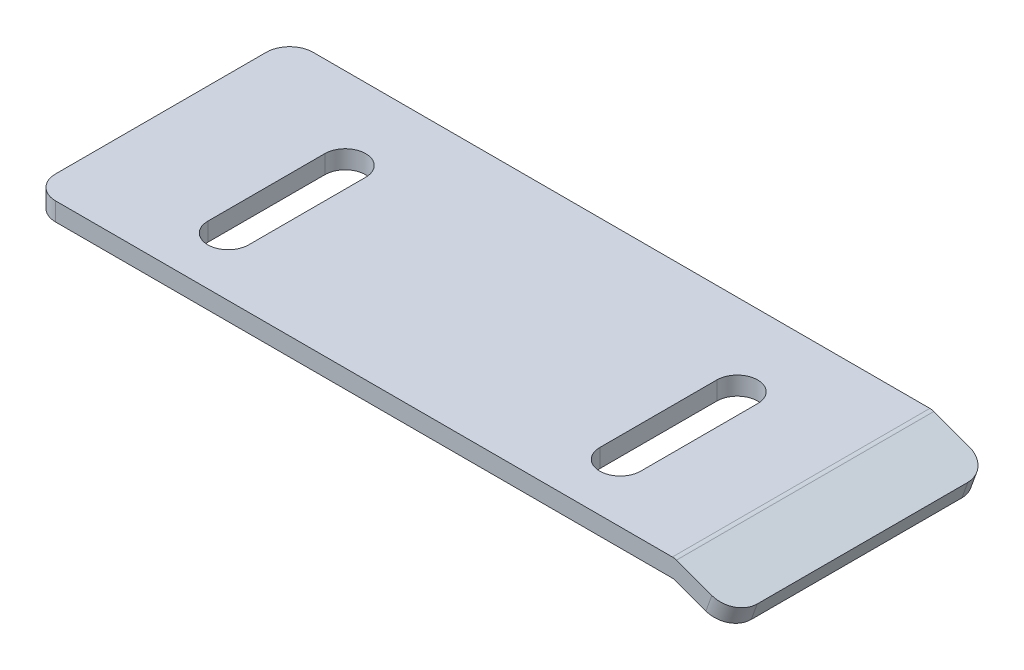
ISO-10303-21;
HEADER;
FILE_DESCRIPTION(('STEP AP214'),'2;1');
FILE_NAME('part.step','',(''),(''),'','','');
FILE_SCHEMA(('AUTOMOTIVE_DESIGN { 1 0 10303 214 1 1 1 1 }'));
ENDSEC;
DATA;
#1=APPLICATION_CONTEXT('core data for automotive mechanical design processes');
#2=APPLICATION_PROTOCOL_DEFINITION('international standard','automotive_design',2000,#1);
#3=PRODUCT_CONTEXT('',#1,'mechanical');
#4=PRODUCT('Part','Part','',(#3));
#5=PRODUCT_RELATED_PRODUCT_CATEGORY('part','',(#4));
#6=PRODUCT_DEFINITION_FORMATION('','',#4);
#7=PRODUCT_DEFINITION_CONTEXT('part definition',#1,'design');
#8=PRODUCT_DEFINITION('design','',#6,#7);
#9=PRODUCT_DEFINITION_SHAPE('','',#8);
#10=(LENGTH_UNIT() NAMED_UNIT(*) SI_UNIT(.MILLI.,.METRE.));
#11=(NAMED_UNIT(*) PLANE_ANGLE_UNIT() SI_UNIT($,.RADIAN.));
#12=(NAMED_UNIT(*) SI_UNIT($,.STERADIAN.) SOLID_ANGLE_UNIT());
#13=UNCERTAINTY_MEASURE_WITH_UNIT(LENGTH_MEASURE(1.E-05),#10,'distance_accuracy_value','');
#14=(GEOMETRIC_REPRESENTATION_CONTEXT(3) GLOBAL_UNCERTAINTY_ASSIGNED_CONTEXT((#13)) GLOBAL_UNIT_ASSIGNED_CONTEXT((#10,
#11,#12)) REPRESENTATION_CONTEXT('',''));
#15=CARTESIAN_POINT('',(0.,0.,0.));
#16=DIRECTION('',(0.,0.,1.));
#17=DIRECTION('',(1.,0.,0.));
#18=AXIS2_PLACEMENT_3D('',#15,#16,#17);
#19=CARTESIAN_POINT('',(-37.5773457805497,7.01414024321962,22.));
#20=DIRECTION('',(1.,0.,0.));
#21=DIRECTION('',(0.,1.,0.));
#22=AXIS2_PLACEMENT_3D('',#19,#20,#21);
#23=PLANE('',#22);
#24=DIRECTION('',(0.,0.,-1.));
#25=VECTOR('',#24,1.);
#26=CARTESIAN_POINT('',(-37.5773457805497,7.01414024321962,22.));
#27=LINE('',#26,#25);
#28=CARTESIAN_POINT('',(-37.5773457805497,7.01414024321962,20.));
#29=VERTEX_POINT('',#28);
#30=CARTESIAN_POINT('',(-37.5773457805497,7.01414024321962,2.));
#31=VERTEX_POINT('',#30);
#32=EDGE_CURVE('E264',#29,#31,#27,.T.);
#33=ORIENTED_EDGE('',*,*,#32,.F.);
#34=DIRECTION('',(0.,-1.,0.));
#35=VECTOR('',#34,1.);
#36=CARTESIAN_POINT('',(-37.5773457805497,7.01414024321962,20.));
#37=LINE('',#36,#35);
#38=CARTESIAN_POINT('',(-37.5773457805497,8.5792292670785,20.));
#39=VERTEX_POINT('',#38);
#40=EDGE_CURVE('E291',#29,#39,#37,.F.);
#41=ORIENTED_EDGE('',*,*,#40,.T.);
#42=DIRECTION('',(0.,0.,-1.));
#43=VECTOR('',#42,1.);
#44=CARTESIAN_POINT('',(-37.5773457805497,8.5792292670785,22.));
#45=LINE('',#44,#43);
#46=CARTESIAN_POINT('',(-37.5773457805497,8.5792292670785,2.));
#47=VERTEX_POINT('',#46);
#48=EDGE_CURVE('E244',#39,#47,#45,.T.);
#49=ORIENTED_EDGE('',*,*,#48,.T.);
#50=DIRECTION('',(0.,-1.,0.));
#51=VECTOR('',#50,1.);
#52=CARTESIAN_POINT('',(-37.5773457805497,7.01414024321962,2.));
#53=LINE('',#52,#51);
#54=EDGE_CURVE('E288',#47,#31,#53,.T.);
#55=ORIENTED_EDGE('',*,*,#54,.T.);
#56=EDGE_LOOP('',(#33,#41,#49,#55));
#57=FACE_BOUND('',#56,.T.);
#58=ADVANCED_FACE('F33',(#57),#23,.F.);
#59=CARTESIAN_POINT('',(17.2226542194503,7.01414024321963,22.));
#60=DIRECTION('',(0.,1.,0.));
#61=DIRECTION('',(-1.,0.,0.));
#62=AXIS2_PLACEMENT_3D('',#59,#60,#61);
#63=PLANE('',#62);
#64=DIRECTION('',(0.,0.,1.));
#65=VECTOR('',#64,1.);
#66=CARTESIAN_POINT('',(5.92265421945034,7.01414024321963,22.));
#67=LINE('',#66,#65);
#68=CARTESIAN_POINT('',(5.92265421945034,7.01414024321963,7.));
#69=VERTEX_POINT('',#68);
#70=CARTESIAN_POINT('',(5.92265421945034,7.01414024321963,17.));
#71=VERTEX_POINT('',#70);
#72=EDGE_CURVE('E194',#69,#71,#67,.T.);
#73=ORIENTED_EDGE('',*,*,#72,.T.);
#74=CARTESIAN_POINT('',(7.67265421945034,7.01414024321963,17.));
#75=DIRECTION('',(0.,1.,0.));
#76=DIRECTION('',(-1.,0.,0.));
#77=AXIS2_PLACEMENT_3D('',#74,#75,#76);
#78=CIRCLE('',#77,1.75);
#79=CARTESIAN_POINT('',(9.42265421945033,7.01414024321963,17.));
#80=VERTEX_POINT('',#79);
#81=EDGE_CURVE('E197',#71,#80,#78,.T.);
#82=ORIENTED_EDGE('',*,*,#81,.T.);
#83=DIRECTION('',(0.,0.,-1.));
#84=VECTOR('',#83,1.);
#85=CARTESIAN_POINT('',(9.42265421945033,7.01414024321963,22.));
#86=LINE('',#85,#84);
#87=CARTESIAN_POINT('',(9.42265421945033,7.01414024321963,7.));
#88=VERTEX_POINT('',#87);
#89=EDGE_CURVE('E189',#80,#88,#86,.T.);
#90=ORIENTED_EDGE('',*,*,#89,.T.);
#91=CARTESIAN_POINT('',(7.67265421945034,7.01414024321963,7.));
#92=DIRECTION('',(0.,1.,0.));
#93=DIRECTION('',(-1.,0.,0.));
#94=AXIS2_PLACEMENT_3D('',#91,#92,#93);
#95=CIRCLE('',#94,1.75);
#96=EDGE_CURVE('E169',#88,#69,#95,.T.);
#97=ORIENTED_EDGE('',*,*,#96,.T.);
#98=EDGE_LOOP('',(#73,#82,#90,#97));
#99=FACE_BOUND('',#98,.T.);
#100=DIRECTION('',(0.,0.,1.));
#101=VECTOR('',#100,1.);
#102=CARTESIAN_POINT('',(-27.5773457805497,7.01414024321962,22.));
#103=LINE('',#102,#101);
#104=CARTESIAN_POINT('',(-27.5773457805497,7.01414024321962,7.));
#105=VERTEX_POINT('',#104);
#106=CARTESIAN_POINT('',(-27.5773457805497,7.01414024321962,17.));
#107=VERTEX_POINT('',#106);
#108=EDGE_CURVE('E226',#105,#107,#103,.T.);
#109=ORIENTED_EDGE('',*,*,#108,.T.);
#110=CARTESIAN_POINT('',(-25.8273457805497,7.01414024321962,17.));
#111=DIRECTION('',(0.,1.,0.));
#112=DIRECTION('',(-1.,0.,0.));
#113=AXIS2_PLACEMENT_3D('',#110,#111,#112);
#114=CIRCLE('',#113,1.75);
#115=CARTESIAN_POINT('',(-24.0773457805497,7.01414024321962,17.));
#116=VERTEX_POINT('',#115);
#117=EDGE_CURVE('E229',#107,#116,#114,.T.);
#118=ORIENTED_EDGE('',*,*,#117,.T.);
#119=DIRECTION('',(0.,0.,-1.));
#120=VECTOR('',#119,1.);
#121=CARTESIAN_POINT('',(-24.0773457805497,7.01414024321962,22.));
#122=LINE('',#121,#120);
#123=CARTESIAN_POINT('',(-24.0773457805497,7.01414024321962,7.));
#124=VERTEX_POINT('',#123);
#125=EDGE_CURVE('E214',#116,#124,#122,.T.);
#126=ORIENTED_EDGE('',*,*,#125,.T.);
#127=CARTESIAN_POINT('',(-25.8273457805497,7.01414024321962,7.));
#128=DIRECTION('',(0.,1.,0.));
#129=DIRECTION('',(-1.,0.,0.));
#130=AXIS2_PLACEMENT_3D('',#127,#128,#129);
#131=CIRCLE('',#130,1.75);
#132=EDGE_CURVE('E223',#124,#105,#131,.T.);
#133=ORIENTED_EDGE('',*,*,#132,.T.);
#134=EDGE_LOOP('',(#109,#118,#126,#133));
#135=FACE_BOUND('',#134,.T.);
#136=DIRECTION('',(1.,0.,0.));
#137=VECTOR('',#136,1.);
#138=CARTESIAN_POINT('',(17.2226542194503,7.01414024321963,22.));
#139=LINE('',#138,#137);
#140=CARTESIAN_POINT('',(-35.5773457805496,7.01414024321962,22.));
#141=VERTEX_POINT('',#140);
#142=CARTESIAN_POINT('',(17.2226542194503,7.01414024321963,22.));
#143=VERTEX_POINT('',#142);
#144=EDGE_CURVE('E233',#141,#143,#139,.T.);
#145=ORIENTED_EDGE('',*,*,#144,.F.);
#146=CARTESIAN_POINT('',(-35.5773457805497,7.01414024321962,20.));
#147=DIRECTION('',(0.,1.,0.));
#148=DIRECTION('',(-1.,0.,0.));
#149=AXIS2_PLACEMENT_3D('',#146,#147,#148);
#150=CIRCLE('',#149,2.);
#151=EDGE_CURVE('E286',#141,#29,#150,.F.);
#152=ORIENTED_EDGE('',*,*,#151,.T.);
#153=ORIENTED_EDGE('',*,*,#32,.T.);
#154=CARTESIAN_POINT('',(-35.5773457805497,7.01414024321962,2.));
#155=DIRECTION('',(0.,1.,0.));
#156=DIRECTION('',(-1.,0.,0.));
#157=AXIS2_PLACEMENT_3D('',#154,#155,#156);
#158=CIRCLE('',#157,2.);
#159=CARTESIAN_POINT('',(-35.5773457805496,7.01414024321962,0.));
#160=VERTEX_POINT('',#159);
#161=EDGE_CURVE('E284',#31,#160,#158,.F.);
#162=ORIENTED_EDGE('',*,*,#161,.T.);
#163=DIRECTION('',(1.,0.,0.));
#164=VECTOR('',#163,1.);
#165=CARTESIAN_POINT('',(17.2226542194503,7.01414024321963,0.));
#166=LINE('',#165,#164);
#167=CARTESIAN_POINT('',(17.2226542194503,7.01414024321963,0.));
#168=VERTEX_POINT('',#167);
#169=EDGE_CURVE('E232',#160,#168,#166,.T.);
#170=ORIENTED_EDGE('',*,*,#169,.T.);
#171=DIRECTION('',(0.,0.,-1.));
#172=VECTOR('',#171,1.);
#173=CARTESIAN_POINT('',(17.2226542194503,7.01414024321963,22.));
#174=LINE('',#173,#172);
#175=EDGE_CURVE('E261',#143,#168,#174,.T.);
#176=ORIENTED_EDGE('',*,*,#175,.F.);
#177=EDGE_LOOP('',(#145,#152,#153,#162,#170,#176));
#178=FACE_BOUND('',#177,.T.);
#179=ADVANCED_FACE('F359',(#99,#135,#178),#63,.F.);
#180=CARTESIAN_POINT('',(21.8696240044618,5.32278156194103,22.));
#181=DIRECTION('',(0.342020143325669,0.939692620785908,0.));
#182=DIRECTION('',(-0.939692620785908,0.342020143325669,0.));
#183=AXIS2_PLACEMENT_3D('',#180,#181,#182);
#184=PLANE('',#183);
#185=DIRECTION('',(0.,0.,-1.));
#186=VECTOR('',#185,1.);
#187=CARTESIAN_POINT('',(21.8696240044618,5.32278156194103,22.));
#188=LINE('',#187,#186);
#189=CARTESIAN_POINT('',(21.8696240044618,5.32278156194103,20.));
#190=VERTEX_POINT('',#189);
#191=CARTESIAN_POINT('',(21.8696240044618,5.32278156194103,2.));
#192=VERTEX_POINT('',#191);
#193=EDGE_CURVE('E258',#190,#192,#188,.T.);
#194=ORIENTED_EDGE('',*,*,#193,.F.);
#195=CARTESIAN_POINT('',(19.99023876289,6.00682184859236,20.));
#196=DIRECTION('',(0.342020143325669,0.939692620785908,0.));
#197=DIRECTION('',(-0.939692620785908,0.342020143325669,0.));
#198=AXIS2_PLACEMENT_3D('',#195,#196,#197);
#199=CIRCLE('',#198,2.);
#200=CARTESIAN_POINT('',(19.99023876289,6.00682184859236,22.));
#201=VERTEX_POINT('',#200);
#202=EDGE_CURVE('E11',#190,#201,#199,.F.);
#203=ORIENTED_EDGE('',*,*,#202,.T.);
#204=DIRECTION('',(0.939692620785908,-0.342020143325669,0.));
#205=VECTOR('',#204,1.);
#206=CARTESIAN_POINT('',(21.8696240044618,5.32278156194103,22.));
#207=LINE('',#206,#205);
#208=EDGE_CURVE('E235',#143,#201,#207,.T.);
#209=ORIENTED_EDGE('',*,*,#208,.F.);
#210=ORIENTED_EDGE('',*,*,#175,.T.);
#211=DIRECTION('',(0.939692620785908,-0.342020143325669,0.));
#212=VECTOR('',#211,1.);
#213=CARTESIAN_POINT('',(21.8696240044618,5.32278156194103,0.));
#214=LINE('',#213,#212);
#215=CARTESIAN_POINT('',(19.99023876289,6.00682184859236,0.));
#216=VERTEX_POINT('',#215);
#217=EDGE_CURVE('E246',#168,#216,#214,.T.);
#218=ORIENTED_EDGE('',*,*,#217,.T.);
#219=CARTESIAN_POINT('',(19.99023876289,6.00682184859237,2.));
#220=DIRECTION('',(0.342020143325669,0.939692620785908,0.));
#221=DIRECTION('',(-0.939692620785908,0.342020143325669,0.));
#222=AXIS2_PLACEMENT_3D('',#219,#220,#221);
#223=CIRCLE('',#222,2.);
#224=EDGE_CURVE('E41',#216,#192,#223,.F.);
#225=ORIENTED_EDGE('',*,*,#224,.T.);
#226=EDGE_LOOP('',(#194,#203,#209,#210,#218,#225));
#227=FACE_BOUND('',#226,.T.);
#228=ADVANCED_FACE('F312',(#227),#184,.F.);
#229=CARTESIAN_POINT('',(22.3826542194503,6.73232049311989,22.));
#230=DIRECTION('',(-0.939692620785908,0.342020143325669,0.));
#231=DIRECTION('',(-0.342020143325669,-0.939692620785908,0.));
#232=AXIS2_PLACEMENT_3D('',#229,#230,#231);
#233=PLANE('',#232);
#234=DIRECTION('',(0.,0.,-1.));
#235=VECTOR('',#234,1.);
#236=CARTESIAN_POINT('',(22.3826542194503,6.73232049311989,22.));
#237=LINE('',#236,#235);
#238=CARTESIAN_POINT('',(22.3826542194503,6.73232049311989,20.));
#239=VERTEX_POINT('',#238);
#240=CARTESIAN_POINT('',(22.3826542194503,6.73232049311989,2.));
#241=VERTEX_POINT('',#240);
#242=EDGE_CURVE('E255',#239,#241,#237,.T.);
#243=ORIENTED_EDGE('',*,*,#242,.F.);
#244=DIRECTION('',(0.342020143325669,0.939692620785908,0.));
#245=VECTOR('',#244,1.);
#246=CARTESIAN_POINT('',(22.3826542194503,6.73232049311989,20.));
#247=LINE('',#246,#245);
#248=EDGE_CURVE('E308',#239,#190,#247,.F.);
#249=ORIENTED_EDGE('',*,*,#248,.T.);
#250=ORIENTED_EDGE('',*,*,#193,.T.);
#251=DIRECTION('',(0.342020143325669,0.939692620785908,0.));
#252=VECTOR('',#251,1.);
#253=CARTESIAN_POINT('',(22.3826542194503,6.73232049311989,2.));
#254=LINE('',#253,#252);
#255=EDGE_CURVE('E305',#192,#241,#254,.T.);
#256=ORIENTED_EDGE('',*,*,#255,.T.);
#257=EDGE_LOOP('',(#243,#249,#250,#256));
#258=FACE_BOUND('',#257,.T.);
#259=ADVANCED_FACE('F320',(#258),#233,.F.);
#260=CARTESIAN_POINT('',(17.3083140672064,8.5792292670785,22.));
#261=DIRECTION('',(-0.342020143325669,-0.939692620785908,0.));
#262=DIRECTION('',(0.939692620785908,-0.342020143325669,0.));
#263=AXIS2_PLACEMENT_3D('',#260,#261,#262);
#264=PLANE('',#263);
#265=DIRECTION('',(-0.939692620785908,0.342020143325669,0.));
#266=VECTOR('',#265,1.);
#267=CARTESIAN_POINT('',(17.3083140672064,8.5792292670785,22.));
#268=LINE('',#267,#266);
#269=CARTESIAN_POINT('',(20.5032689778785,7.41636077977123,22.));
#270=VERTEX_POINT('',#269);
#271=CARTESIAN_POINT('',(17.4740072298236,8.51892188786441,22.));
#272=VERTEX_POINT('',#271);
#273=EDGE_CURVE('E239',#270,#272,#268,.T.);
#274=ORIENTED_EDGE('',*,*,#273,.F.);
#275=CARTESIAN_POINT('',(20.5032689778785,7.41636077977123,20.));
#276=DIRECTION('',(-0.342020143325669,-0.939692620785908,0.));
#277=DIRECTION('',(0.939692620785908,-0.342020143325669,0.));
#278=AXIS2_PLACEMENT_3D('',#275,#276,#277);
#279=CIRCLE('',#278,2.);
#280=EDGE_CURVE('E303',#270,#239,#279,.F.);
#281=ORIENTED_EDGE('',*,*,#280,.T.);
#282=ORIENTED_EDGE('',*,*,#242,.T.);
#283=CARTESIAN_POINT('',(20.5032689778785,7.41636077977123,2.));
#284=DIRECTION('',(-0.342020143325669,-0.939692620785908,0.));
#285=DIRECTION('',(0.939692620785908,-0.342020143325669,0.));
#286=AXIS2_PLACEMENT_3D('',#283,#284,#285);
#287=CIRCLE('',#286,2.);
#288=CARTESIAN_POINT('',(20.5032689778785,7.41636077977123,0.));
#289=VERTEX_POINT('',#288);
#290=EDGE_CURVE('E301',#241,#289,#287,.F.);
#291=ORIENTED_EDGE('',*,*,#290,.T.);
#292=DIRECTION('',(-0.939692620785908,0.342020143325669,0.));
#293=VECTOR('',#292,1.);
#294=CARTESIAN_POINT('',(17.3083140672064,8.5792292670785,0.));
#295=LINE('',#294,#293);
#296=CARTESIAN_POINT('',(17.4740072298236,8.51892188786441,0.));
#297=VERTEX_POINT('',#296);
#298=EDGE_CURVE('E249',#289,#297,#295,.T.);
#299=ORIENTED_EDGE('',*,*,#298,.T.);
#300=DIRECTION('',(0.,0.,-1.));
#301=VECTOR('',#300,1.);
#302=CARTESIAN_POINT('',(17.4740072298236,8.51892188786441,22.));
#303=LINE('',#302,#301);
#304=EDGE_CURVE('E273',#297,#272,#303,.F.);
#305=ORIENTED_EDGE('',*,*,#304,.T.);
#306=EDGE_LOOP('',(#274,#281,#282,#291,#299,#305));
#307=FACE_BOUND('',#306,.T.);
#308=ADVANCED_FACE('F325',(#307),#264,.F.);
#309=CARTESIAN_POINT('',(-37.5773457805497,8.5792292670785,22.));
#310=DIRECTION('',(0.,-1.,0.));
#311=DIRECTION('',(0.,0.,-1.));
#312=AXIS2_PLACEMENT_3D('',#309,#310,#311);
#313=PLANE('',#312);
#314=DIRECTION('',(0.,0.,-1.));
#315=VECTOR('',#314,1.);
#316=CARTESIAN_POINT('',(9.42265421945033,8.5792292670785,17.));
#317=LINE('',#316,#315);
#318=CARTESIAN_POINT('',(9.42265421945033,8.5792292670785,17.));
#319=VERTEX_POINT('',#318);
#320=CARTESIAN_POINT('',(9.42265421945033,8.5792292670785,7.));
#321=VERTEX_POINT('',#320);
#322=EDGE_CURVE('E175',#319,#321,#317,.T.);
#323=ORIENTED_EDGE('',*,*,#322,.F.);
#324=CARTESIAN_POINT('',(7.67265421945034,8.5792292670785,17.));
#325=DIRECTION('',(0.,1.,0.));
#326=DIRECTION('',(0.,0.,1.));
#327=AXIS2_PLACEMENT_3D('',#324,#325,#326);
#328=CIRCLE('',#327,1.75);
#329=CARTESIAN_POINT('',(5.92265421945034,8.5792292670785,17.));
#330=VERTEX_POINT('',#329);
#331=EDGE_CURVE('E56',#330,#319,#328,.T.);
#332=ORIENTED_EDGE('',*,*,#331,.F.);
#333=DIRECTION('',(0.,0.,1.));
#334=VECTOR('',#333,1.);
#335=CARTESIAN_POINT('',(5.92265421945034,8.5792292670785,17.));
#336=LINE('',#335,#334);
#337=CARTESIAN_POINT('',(5.92265421945034,8.5792292670785,7.));
#338=VERTEX_POINT('',#337);
#339=EDGE_CURVE('E182',#338,#330,#336,.T.);
#340=ORIENTED_EDGE('',*,*,#339,.F.);
#341=CARTESIAN_POINT('',(7.67265421945034,8.5792292670785,7.));
#342=DIRECTION('',(0.,1.,0.));
#343=DIRECTION('',(0.,0.,1.));
#344=AXIS2_PLACEMENT_3D('',#341,#342,#343);
#345=CIRCLE('',#344,1.75);
#346=EDGE_CURVE('E166',#321,#338,#345,.T.);
#347=ORIENTED_EDGE('',*,*,#346,.F.);
#348=EDGE_LOOP('',(#323,#332,#340,#347));
#349=FACE_BOUND('',#348,.T.);
#350=DIRECTION('',(0.,0.,-1.));
#351=VECTOR('',#350,1.);
#352=CARTESIAN_POINT('',(-24.0773457805497,8.5792292670785,17.));
#353=LINE('',#352,#351);
#354=CARTESIAN_POINT('',(-24.0773457805497,8.5792292670785,17.));
#355=VERTEX_POINT('',#354);
#356=CARTESIAN_POINT('',(-24.0773457805497,8.5792292670785,7.));
#357=VERTEX_POINT('',#356);
#358=EDGE_CURVE('E202',#355,#357,#353,.T.);
#359=ORIENTED_EDGE('',*,*,#358,.F.);
#360=CARTESIAN_POINT('',(-25.8273457805497,8.5792292670785,17.));
#361=DIRECTION('',(0.,1.,0.));
#362=DIRECTION('',(0.,0.,1.));
#363=AXIS2_PLACEMENT_3D('',#360,#361,#362);
#364=CIRCLE('',#363,1.75);
#365=CARTESIAN_POINT('',(-27.5773457805497,8.5792292670785,17.));
#366=VERTEX_POINT('',#365);
#367=EDGE_CURVE('E200',#366,#355,#364,.T.);
#368=ORIENTED_EDGE('',*,*,#367,.F.);
#369=DIRECTION('',(0.,0.,1.));
#370=VECTOR('',#369,1.);
#371=CARTESIAN_POINT('',(-27.5773457805497,8.5792292670785,17.));
#372=LINE('',#371,#370);
#373=CARTESIAN_POINT('',(-27.5773457805497,8.5792292670785,7.));
#374=VERTEX_POINT('',#373);
#375=EDGE_CURVE('E208',#374,#366,#372,.T.);
#376=ORIENTED_EDGE('',*,*,#375,.F.);
#377=CARTESIAN_POINT('',(-25.8273457805497,8.5792292670785,7.));
#378=DIRECTION('',(0.,1.,0.));
#379=DIRECTION('',(0.,0.,1.));
#380=AXIS2_PLACEMENT_3D('',#377,#378,#379);
#381=CIRCLE('',#380,1.75);
#382=EDGE_CURVE('E205',#357,#374,#381,.T.);
#383=ORIENTED_EDGE('',*,*,#382,.F.);
#384=EDGE_LOOP('',(#359,#368,#376,#383));
#385=FACE_BOUND('',#384,.T.);
#386=ORIENTED_EDGE('',*,*,#48,.F.);
#387=CARTESIAN_POINT('',(-35.5773457805497,8.5792292670785,20.));
#388=DIRECTION('',(0.,-1.,0.));
#389=DIRECTION('',(0.,0.,-1.));
#390=AXIS2_PLACEMENT_3D('',#387,#388,#389);
#391=CIRCLE('',#390,2.);
#392=CARTESIAN_POINT('',(-35.5773457805497,8.5792292670785,22.));
#393=VERTEX_POINT('',#392);
#394=EDGE_CURVE('E295',#39,#393,#391,.F.);
#395=ORIENTED_EDGE('',*,*,#394,.T.);
#396=DIRECTION('',(-1.,0.,0.));
#397=VECTOR('',#396,1.);
#398=CARTESIAN_POINT('',(-37.5773457805497,8.5792292670785,22.));
#399=LINE('',#398,#397);
#400=CARTESIAN_POINT('',(17.1319870864979,8.5792292670785,22.));
#401=VERTEX_POINT('',#400);
#402=EDGE_CURVE('E241',#401,#393,#399,.T.);
#403=ORIENTED_EDGE('',*,*,#402,.F.);
#404=DIRECTION('',(0.,0.,-1.));
#405=VECTOR('',#404,1.);
#406=CARTESIAN_POINT('',(17.131987086498,8.5792292670785,22.));
#407=LINE('',#406,#405);
#408=CARTESIAN_POINT('',(17.1319870864979,8.5792292670785,0.));
#409=VERTEX_POINT('',#408);
#410=EDGE_CURVE('E267',#401,#409,#407,.T.);
#411=ORIENTED_EDGE('',*,*,#410,.T.);
#412=DIRECTION('',(-1.,0.,0.));
#413=VECTOR('',#412,1.);
#414=CARTESIAN_POINT('',(-37.5773457805497,8.5792292670785,0.));
#415=LINE('',#414,#413);
#416=CARTESIAN_POINT('',(-35.5773457805497,8.5792292670785,0.));
#417=VERTEX_POINT('',#416);
#418=EDGE_CURVE('E236',#409,#417,#415,.T.);
#419=ORIENTED_EDGE('',*,*,#418,.T.);
#420=CARTESIAN_POINT('',(-35.5773457805497,8.5792292670785,2.));
#421=DIRECTION('',(0.,-1.,0.));
#422=DIRECTION('',(0.,0.,-1.));
#423=AXIS2_PLACEMENT_3D('',#420,#421,#422);
#424=CIRCLE('',#423,2.);
#425=EDGE_CURVE('E293',#417,#47,#424,.F.);
#426=ORIENTED_EDGE('',*,*,#425,.T.);
#427=EDGE_LOOP('',(#386,#395,#403,#411,#419,#426));
#428=FACE_BOUND('',#427,.T.);
#429=ADVANCED_FACE('F179',(#349,#385,#428),#313,.F.);
#430=CARTESIAN_POINT('',(0.,0.,22.));
#431=DIRECTION('',(0.,0.,-1.));
#432=DIRECTION('',(-1.,0.,0.));
#433=AXIS2_PLACEMENT_3D('',#430,#431,#432);
#434=PLANE('',#433);
#435=ORIENTED_EDGE('',*,*,#402,.T.);
#436=DIRECTION('',(0.,-1.,0.));
#437=VECTOR('',#436,1.);
#438=CARTESIAN_POINT('',(-35.5773457805496,-1.57733792768656E-13,22.));
#439=LINE('',#438,#437);
#440=EDGE_CURVE('E281',#393,#141,#439,.T.);
#441=ORIENTED_EDGE('',*,*,#440,.T.);
#442=ORIENTED_EDGE('',*,*,#144,.T.);
#443=ORIENTED_EDGE('',*,*,#208,.T.);
#444=DIRECTION('',(0.342020143325669,0.939692620785908,0.));
#445=VECTOR('',#444,1.);
#446=CARTESIAN_POINT('',(15.721269712977,-5.72207422039438,22.));
#447=LINE('',#446,#445);
#448=EDGE_CURVE('E278',#201,#270,#447,.T.);
#449=ORIENTED_EDGE('',*,*,#448,.T.);
#450=ORIENTED_EDGE('',*,*,#273,.T.);
#451=CARTESIAN_POINT('',(17.131987086498,7.5792292670785,22.));
#452=DIRECTION('',(0.,0.,-1.));
#453=DIRECTION('',(-1.,0.,0.));
#454=AXIS2_PLACEMENT_3D('',#451,#452,#453);
#455=CIRCLE('',#454,1.);
#456=EDGE_CURVE('E276',#272,#401,#455,.F.);
#457=ORIENTED_EDGE('',*,*,#456,.T.);
#458=EDGE_LOOP('',(#435,#441,#442,#443,#449,#450,#457));
#459=FACE_BOUND('',#458,.T.);
#460=ADVANCED_FACE('F336',(#459),#434,.F.);
#461=CARTESIAN_POINT('',(0.,0.,0.));
#462=DIRECTION('',(0.,0.,-1.));
#463=DIRECTION('',(-1.,0.,0.));
#464=AXIS2_PLACEMENT_3D('',#461,#462,#463);
#465=PLANE('',#464);
#466=ORIENTED_EDGE('',*,*,#169,.F.);
#467=DIRECTION('',(0.,-1.,0.));
#468=VECTOR('',#467,1.);
#469=CARTESIAN_POINT('',(-35.5773457805497,8.57922926707851,0.));
#470=LINE('',#469,#468);
#471=EDGE_CURVE('E299',#160,#417,#470,.F.);
#472=ORIENTED_EDGE('',*,*,#471,.T.);
#473=ORIENTED_EDGE('',*,*,#418,.F.);
#474=CARTESIAN_POINT('',(17.131987086498,7.5792292670785,0.));
#475=DIRECTION('',(0.,0.,-1.));
#476=DIRECTION('',(-1.,0.,0.));
#477=AXIS2_PLACEMENT_3D('',#474,#475,#476);
#478=CIRCLE('',#477,1.);
#479=EDGE_CURVE('E270',#409,#297,#478,.T.);
#480=ORIENTED_EDGE('',*,*,#479,.T.);
#481=ORIENTED_EDGE('',*,*,#298,.F.);
#482=DIRECTION('',(0.342020143325669,0.939692620785908,0.));
#483=VECTOR('',#482,1.);
#484=CARTESIAN_POINT('',(19.99023876289,6.00682184859236,0.));
#485=LINE('',#484,#483);
#486=EDGE_CURVE('E297',#289,#216,#485,.F.);
#487=ORIENTED_EDGE('',*,*,#486,.T.);
#488=ORIENTED_EDGE('',*,*,#217,.F.);
#489=EDGE_LOOP('',(#466,#472,#473,#480,#481,#487,#488));
#490=FACE_BOUND('',#489,.T.);
#491=ADVANCED_FACE('F328',(#490),#465,.T.);
#492=CARTESIAN_POINT('',(17.131987086498,7.5792292670785,22.));
#493=DIRECTION('',(0.,0.,-1.));
#494=DIRECTION('',(-1.,0.,0.));
#495=AXIS2_PLACEMENT_3D('',#492,#493,#494);
#496=CYLINDRICAL_SURFACE('',#495,1.);
#497=ORIENTED_EDGE('',*,*,#456,.F.);
#498=ORIENTED_EDGE('',*,*,#304,.F.);
#499=ORIENTED_EDGE('',*,*,#479,.F.);
#500=ORIENTED_EDGE('',*,*,#410,.F.);
#501=EDGE_LOOP('',(#497,#498,#499,#500));
#502=FACE_BOUND('',#501,.T.);
#503=ADVANCED_FACE('F334',(#502),#496,.T.);
#504=CARTESIAN_POINT('',(-35.5773457805496,-1.57733792768656E-13,20.));
#505=DIRECTION('',(0.,-1.,0.));
#506=DIRECTION('',(1.,0.,0.));
#507=AXIS2_PLACEMENT_3D('',#504,#505,#506);
#508=CYLINDRICAL_SURFACE('',#507,2.);
#509=ORIENTED_EDGE('',*,*,#394,.F.);
#510=ORIENTED_EDGE('',*,*,#40,.F.);
#511=ORIENTED_EDGE('',*,*,#151,.F.);
#512=ORIENTED_EDGE('',*,*,#440,.F.);
#513=EDGE_LOOP('',(#509,#510,#511,#512));
#514=FACE_BOUND('',#513,.T.);
#515=ADVANCED_FACE('F357',(#514),#508,.T.);
#516=CARTESIAN_POINT('',(-35.5773457805497,7.01414024321963,2.));
#517=DIRECTION('',(0.,1.,0.));
#518=DIRECTION('',(-1.,0.,0.));
#519=AXIS2_PLACEMENT_3D('',#516,#517,#518);
#520=CYLINDRICAL_SURFACE('',#519,2.);
#521=ORIENTED_EDGE('',*,*,#425,.F.);
#522=ORIENTED_EDGE('',*,*,#471,.F.);
#523=ORIENTED_EDGE('',*,*,#161,.F.);
#524=ORIENTED_EDGE('',*,*,#54,.F.);
#525=EDGE_LOOP('',(#521,#522,#523,#524));
#526=FACE_BOUND('',#525,.T.);
#527=ADVANCED_FACE('F348',(#526),#520,.T.);
#528=CARTESIAN_POINT('',(15.721269712977,-5.72207422039438,20.));
#529=DIRECTION('',(0.342020143325669,0.939692620785908,0.));
#530=DIRECTION('',(-0.939692620785908,0.342020143325669,0.));
#531=AXIS2_PLACEMENT_3D('',#528,#529,#530);
#532=CYLINDRICAL_SURFACE('',#531,2.);
#533=ORIENTED_EDGE('',*,*,#202,.F.);
#534=ORIENTED_EDGE('',*,*,#248,.F.);
#535=ORIENTED_EDGE('',*,*,#280,.F.);
#536=ORIENTED_EDGE('',*,*,#448,.F.);
#537=EDGE_LOOP('',(#533,#534,#535,#536));
#538=FACE_BOUND('',#537,.T.);
#539=ADVANCED_FACE('F341',(#538),#532,.T.);
#540=CARTESIAN_POINT('',(20.5032689778785,7.41636077977123,2.));
#541=DIRECTION('',(-0.342020143325669,-0.939692620785908,0.));
#542=DIRECTION('',(0.939692620785908,-0.342020143325669,0.));
#543=AXIS2_PLACEMENT_3D('',#540,#541,#542);
#544=CYLINDRICAL_SURFACE('',#543,2.);
#545=ORIENTED_EDGE('',*,*,#224,.F.);
#546=ORIENTED_EDGE('',*,*,#486,.F.);
#547=ORIENTED_EDGE('',*,*,#290,.F.);
#548=ORIENTED_EDGE('',*,*,#255,.F.);
#549=EDGE_LOOP('',(#545,#546,#547,#548));
#550=FACE_BOUND('',#549,.T.);
#551=ADVANCED_FACE('F35',(#550),#544,.T.);
#552=CARTESIAN_POINT('',(-25.8273457805497,5.32278156194102,17.));
#553=DIRECTION('',(0.,1.,0.));
#554=DIRECTION('',(0.,0.,1.));
#555=AXIS2_PLACEMENT_3D('',#552,#553,#554);
#556=CYLINDRICAL_SURFACE('',#555,1.75);
#557=DIRECTION('',(0.,1.,0.));
#558=VECTOR('',#557,1.);
#559=CARTESIAN_POINT('',(-27.5773457805497,5.32278156194102,17.));
#560=LINE('',#559,#558);
#561=EDGE_CURVE('E212',#107,#366,#560,.T.);
#562=ORIENTED_EDGE('',*,*,#561,.T.);
#563=ORIENTED_EDGE('',*,*,#367,.T.);
#564=DIRECTION('',(0.,1.,0.));
#565=VECTOR('',#564,1.);
#566=CARTESIAN_POINT('',(-24.0773457805497,5.32278156194102,17.));
#567=LINE('',#566,#565);
#568=EDGE_CURVE('E211',#116,#355,#567,.T.);
#569=ORIENTED_EDGE('',*,*,#568,.F.);
#570=ORIENTED_EDGE('',*,*,#117,.F.);
#571=EDGE_LOOP('',(#562,#563,#569,#570));
#572=FACE_BOUND('',#571,.T.);
#573=ADVANCED_FACE('F381',(#572),#556,.F.);
#574=CARTESIAN_POINT('',(-27.5773457805497,5.32278156194102,17.));
#575=DIRECTION('',(-1.,0.,0.));
#576=DIRECTION('',(0.,0.,1.));
#577=AXIS2_PLACEMENT_3D('',#574,#575,#576);
#578=PLANE('',#577);
#579=DIRECTION('',(0.,1.,0.));
#580=VECTOR('',#579,1.);
#581=CARTESIAN_POINT('',(-27.5773457805497,5.32278156194102,7.));
#582=LINE('',#581,#580);
#583=EDGE_CURVE('E215',#105,#374,#582,.T.);
#584=ORIENTED_EDGE('',*,*,#583,.T.);
#585=ORIENTED_EDGE('',*,*,#375,.T.);
#586=ORIENTED_EDGE('',*,*,#561,.F.);
#587=ORIENTED_EDGE('',*,*,#108,.F.);
#588=EDGE_LOOP('',(#584,#585,#586,#587));
#589=FACE_BOUND('',#588,.T.);
#590=ADVANCED_FACE('F385',(#589),#578,.F.);
#591=CARTESIAN_POINT('',(-25.8273457805497,5.32278156194102,7.));
#592=DIRECTION('',(0.,1.,0.));
#593=DIRECTION('',(0.,0.,1.));
#594=AXIS2_PLACEMENT_3D('',#591,#592,#593);
#595=CYLINDRICAL_SURFACE('',#594,1.75);
#596=DIRECTION('',(0.,1.,0.));
#597=VECTOR('',#596,1.);
#598=CARTESIAN_POINT('',(-24.0773457805497,5.32278156194102,7.));
#599=LINE('',#598,#597);
#600=EDGE_CURVE('E217',#124,#357,#599,.T.);
#601=ORIENTED_EDGE('',*,*,#600,.T.);
#602=ORIENTED_EDGE('',*,*,#382,.T.);
#603=ORIENTED_EDGE('',*,*,#583,.F.);
#604=ORIENTED_EDGE('',*,*,#132,.F.);
#605=EDGE_LOOP('',(#601,#602,#603,#604));
#606=FACE_BOUND('',#605,.T.);
#607=ADVANCED_FACE('F391',(#606),#595,.F.);
#608=CARTESIAN_POINT('',(-24.0773457805497,5.32278156194102,17.));
#609=DIRECTION('',(1.,0.,0.));
#610=DIRECTION('',(0.,0.,-1.));
#611=AXIS2_PLACEMENT_3D('',#608,#609,#610);
#612=PLANE('',#611);
#613=ORIENTED_EDGE('',*,*,#568,.T.);
#614=ORIENTED_EDGE('',*,*,#358,.T.);
#615=ORIENTED_EDGE('',*,*,#600,.F.);
#616=ORIENTED_EDGE('',*,*,#125,.F.);
#617=EDGE_LOOP('',(#613,#614,#615,#616));
#618=FACE_BOUND('',#617,.T.);
#619=ADVANCED_FACE('F396',(#618),#612,.F.);
#620=CARTESIAN_POINT('',(7.67265421945034,5.32278156194102,17.));
#621=DIRECTION('',(0.,1.,0.));
#622=DIRECTION('',(0.,0.,1.));
#623=AXIS2_PLACEMENT_3D('',#620,#621,#622);
#624=CYLINDRICAL_SURFACE('',#623,1.75);
#625=DIRECTION('',(0.,1.,0.));
#626=VECTOR('',#625,1.);
#627=CARTESIAN_POINT('',(5.92265421945034,5.32278156194102,17.));
#628=LINE('',#627,#626);
#629=EDGE_CURVE('E187',#71,#330,#628,.T.);
#630=ORIENTED_EDGE('',*,*,#629,.T.);
#631=ORIENTED_EDGE('',*,*,#331,.T.);
#632=DIRECTION('',(0.,1.,0.));
#633=VECTOR('',#632,1.);
#634=CARTESIAN_POINT('',(9.42265421945033,5.32278156194102,17.));
#635=LINE('',#634,#633);
#636=EDGE_CURVE('E172',#80,#319,#635,.T.);
#637=ORIENTED_EDGE('',*,*,#636,.F.);
#638=ORIENTED_EDGE('',*,*,#81,.F.);
#639=EDGE_LOOP('',(#630,#631,#637,#638));
#640=FACE_BOUND('',#639,.T.);
#641=ADVANCED_FACE('F500',(#640),#624,.F.);
#642=CARTESIAN_POINT('',(5.92265421945034,5.32278156194102,17.));
#643=DIRECTION('',(-1.,0.,0.));
#644=DIRECTION('',(0.,0.,1.));
#645=AXIS2_PLACEMENT_3D('',#642,#643,#644);
#646=PLANE('',#645);
#647=DIRECTION('',(0.,1.,0.));
#648=VECTOR('',#647,1.);
#649=CARTESIAN_POINT('',(5.92265421945034,5.32278156194102,7.));
#650=LINE('',#649,#648);
#651=EDGE_CURVE('E171',#69,#338,#650,.T.);
#652=ORIENTED_EDGE('',*,*,#651,.T.);
#653=ORIENTED_EDGE('',*,*,#339,.T.);
#654=ORIENTED_EDGE('',*,*,#629,.F.);
#655=ORIENTED_EDGE('',*,*,#72,.F.);
#656=EDGE_LOOP('',(#652,#653,#654,#655));
#657=FACE_BOUND('',#656,.T.);
#658=ADVANCED_FACE('F508',(#657),#646,.F.);
#659=CARTESIAN_POINT('',(7.67265421945034,5.32278156194102,7.));
#660=DIRECTION('',(0.,1.,0.));
#661=DIRECTION('',(0.,0.,1.));
#662=AXIS2_PLACEMENT_3D('',#659,#660,#661);
#663=CYLINDRICAL_SURFACE('',#662,1.75);
#664=DIRECTION('',(0.,1.,0.));
#665=VECTOR('',#664,1.);
#666=CARTESIAN_POINT('',(9.42265421945033,5.32278156194102,7.));
#667=LINE('',#666,#665);
#668=EDGE_CURVE('E48',#88,#321,#667,.T.);
#669=ORIENTED_EDGE('',*,*,#668,.T.);
#670=ORIENTED_EDGE('',*,*,#346,.T.);
#671=ORIENTED_EDGE('',*,*,#651,.F.);
#672=ORIENTED_EDGE('',*,*,#96,.F.);
#673=EDGE_LOOP('',(#669,#670,#671,#672));
#674=FACE_BOUND('',#673,.T.);
#675=ADVANCED_FACE('F163',(#674),#663,.F.);
#676=CARTESIAN_POINT('',(9.42265421945033,5.32278156194102,17.));
#677=DIRECTION('',(1.,0.,0.));
#678=DIRECTION('',(0.,0.,-1.));
#679=AXIS2_PLACEMENT_3D('',#676,#677,#678);
#680=PLANE('',#679);
#681=ORIENTED_EDGE('',*,*,#636,.T.);
#682=ORIENTED_EDGE('',*,*,#322,.T.);
#683=ORIENTED_EDGE('',*,*,#668,.F.);
#684=ORIENTED_EDGE('',*,*,#89,.F.);
#685=EDGE_LOOP('',(#681,#682,#683,#684));
#686=FACE_BOUND('',#685,.T.);
#687=ADVANCED_FACE('F176',(#686),#680,.F.);
#688=CLOSED_SHELL('',(#58,#179,#228,#259,#308,#429,#460,#491,#503,#515,#527,#539,#551,#573,#590,
#607,#619,#641,#658,#675,#687));
#689=MANIFOLD_SOLID_BREP('B2',#688);
#690=ADVANCED_BREP_SHAPE_REPRESENTATION('',(#18,#689),#14);
#691=SHAPE_DEFINITION_REPRESENTATION(#9,#690);
ENDSEC;
END-ISO-10303-21;
